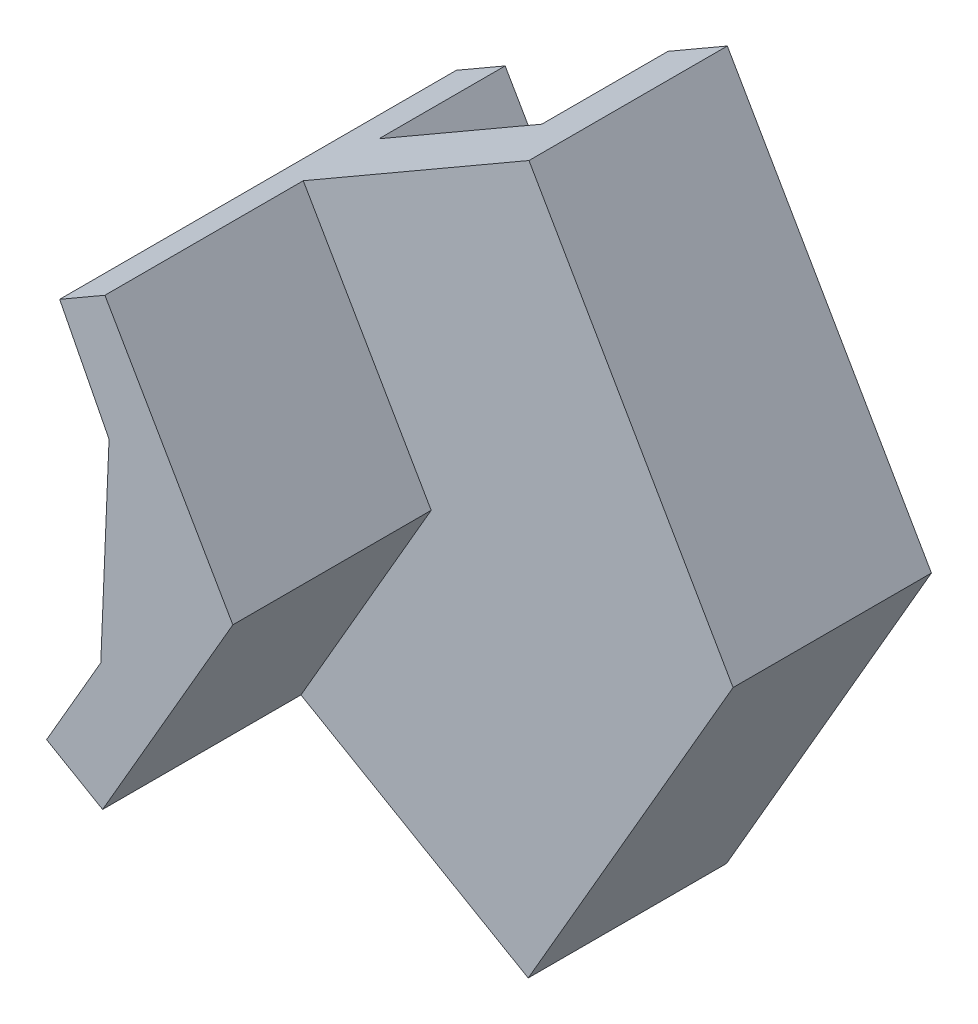
ISO-10303-21;
HEADER;
FILE_DESCRIPTION(('STEP AP214'),'2;1');
FILE_NAME('part.step','',(''),(''),'','','');
FILE_SCHEMA(('AUTOMOTIVE_DESIGN { 1 0 10303 214 1 1 1 1 }'));
ENDSEC;
DATA;
#1=APPLICATION_CONTEXT('core data for automotive mechanical design processes');
#2=APPLICATION_PROTOCOL_DEFINITION('international standard','automotive_design',2000,#1);
#3=PRODUCT_CONTEXT('',#1,'mechanical');
#4=PRODUCT('Part','Part','',(#3));
#5=PRODUCT_RELATED_PRODUCT_CATEGORY('part','',(#4));
#6=PRODUCT_DEFINITION_FORMATION('','',#4);
#7=PRODUCT_DEFINITION_CONTEXT('part definition',#1,'design');
#8=PRODUCT_DEFINITION('design','',#6,#7);
#9=PRODUCT_DEFINITION_SHAPE('','',#8);
#10=(LENGTH_UNIT() NAMED_UNIT(*) SI_UNIT(.MILLI.,.METRE.));
#11=(NAMED_UNIT(*) PLANE_ANGLE_UNIT() SI_UNIT($,.RADIAN.));
#12=(NAMED_UNIT(*) SI_UNIT($,.STERADIAN.) SOLID_ANGLE_UNIT());
#13=UNCERTAINTY_MEASURE_WITH_UNIT(LENGTH_MEASURE(1.E-05),#10,'distance_accuracy_value','');
#14=(GEOMETRIC_REPRESENTATION_CONTEXT(3) GLOBAL_UNCERTAINTY_ASSIGNED_CONTEXT((#13)) GLOBAL_UNIT_ASSIGNED_CONTEXT((#10,
#11,#12)) REPRESENTATION_CONTEXT('',''));
#15=CARTESIAN_POINT('',(0.,0.,0.));
#16=DIRECTION('',(0.,0.,1.));
#17=DIRECTION('',(1.,0.,0.));
#18=AXIS2_PLACEMENT_3D('',#15,#16,#17);
#19=CARTESIAN_POINT('',(0.,0.,0.));
#20=DIRECTION('',(0.,0.,1.));
#21=DIRECTION('',(1.,0.,0.));
#22=AXIS2_PLACEMENT_3D('',#19,#20,#21);
#23=PLANE('',#22);
#24=DIRECTION('',(0.5009159002631,0.865495962361239,0.));
#25=VECTOR('',#24,1.);
#26=CARTESIAN_POINT('',(79.3562570665943,-45.9283609383633,0.));
#27=LINE('',#26,#25);
#28=CARTESIAN_POINT('',(100.841807638242,-8.8050489031459,0.));
#29=VERTEX_POINT('',#28);
#30=CARTESIAN_POINT('',(105.980454031403,0.073642515807458,0.));
#31=VERTEX_POINT('',#30);
#32=EDGE_CURVE('E169',#29,#31,#27,.T.);
#33=ORIENTED_EDGE('',*,*,#32,.F.);
#34=DIRECTION('',(0.865495962361239,-0.500915900263101,0.));
#35=VECTOR('',#34,1.);
#36=CARTESIAN_POINT('',(94.6311821753141,-5.2105768544585,0.));
#37=LINE('',#36,#35);
#38=CARTESIAN_POINT('',(96.3412286339642,-6.20028622177839,0.));
#39=VERTEX_POINT('',#38);
#40=EDGE_CURVE('E236',#39,#29,#37,.T.);
#41=ORIENTED_EDGE('',*,*,#40,.F.);
#42=DIRECTION('',(-0.508210942680143,-0.861232626959848,0.));
#43=VECTOR('',#42,1.);
#44=CARTESIAN_POINT('',(74.1721638004044,-43.7687845369877,0.));
#45=LINE('',#44,#43);
#46=CARTESIAN_POINT('',(100.000000028321,-1.2296559603886E-08,0.));
#47=VERTEX_POINT('',#46);
#48=EDGE_CURVE('E207',#47,#39,#45,.T.);
#49=ORIENTED_EDGE('',*,*,#48,.F.);
#50=DIRECTION('',(0.500000000000233,-0.866025403784304,0.));
#51=VECTOR('',#50,1.);
#52=CARTESIAN_POINT('',(75.0000000158928,43.3012701984246,0.));
#53=LINE('',#52,#51);
#54=CARTESIAN_POINT('',(96.3469671593931,6.32723851840156,0.));
#55=VERTEX_POINT('',#54);
#56=EDGE_CURVE('E202',#55,#47,#53,.T.);
#57=ORIENTED_EDGE('',*,*,#56,.F.);
#58=DIRECTION('',(-0.865938417345993,-0.500150634673512,0.));
#59=VECTOR('',#58,1.);
#60=CARTESIAN_POINT('',(102.507485030802,9.88544411545314,0.));
#61=LINE('',#60,#59);
#62=CARTESIAN_POINT('',(100.862200723799,8.93515715060436,0.));
#63=VERTEX_POINT('',#62);
#64=EDGE_CURVE('E239',#63,#55,#61,.T.);
#65=ORIENTED_EDGE('',*,*,#64,.F.);
#66=DIRECTION('',(-0.500150634673513,0.865938417345993,0.));
#67=VECTOR('',#66,1.);
#68=CARTESIAN_POINT('',(79.5012683354281,45.9185191681202,0.));
#69=LINE('',#68,#67);
#70=EDGE_CURVE('E172',#31,#63,#69,.T.);
#71=ORIENTED_EDGE('',*,*,#70,.F.);
#72=EDGE_LOOP('',(#33,#41,#49,#57,#65,#71));
#73=FACE_BOUND('',#72,.T.);
#74=ADVANCED_FACE('F34',(#73),#23,.F.);
#75=CARTESIAN_POINT('',(96.1339298761034,-2.61408896737479,2.));
#76=DIRECTION('',(0.865495962361239,-0.500915900263102,0.));
#77=DIRECTION('',(0.500915900263102,0.865495962361238,0.));
#78=AXIS2_PLACEMENT_3D('',#75,#76,#77);
#79=PLANE('',#78);
#80=DIRECTION('',(0.,0.,-1.));
#81=VECTOR('',#80,1.);
#82=CARTESIAN_POINT('',(96.1339298761034,-2.61408896737479,2.));
#83=LINE('',#82,#81);
#84=CARTESIAN_POINT('',(96.1339298761034,-2.61408896737479,7.5));
#85=VERTEX_POINT('',#84);
#86=CARTESIAN_POINT('',(96.1339298761034,-2.61408896737479,-3.5));
#87=VERTEX_POINT('',#86);
#88=EDGE_CURVE('E244',#85,#87,#83,.T.);
#89=ORIENTED_EDGE('',*,*,#88,.T.);
#90=DIRECTION('',(0.500915900263102,0.865495962361239,0.));
#91=VECTOR('',#90,1.);
#92=CARTESIAN_POINT('',(73.1456316036667,-42.333888889676,-3.5));
#93=LINE('',#92,#91);
#94=CARTESIAN_POINT('',(94.6311821753141,-5.2105768544585,-3.5));
#95=VERTEX_POINT('',#94);
#96=EDGE_CURVE('E212',#95,#87,#93,.T.);
#97=ORIENTED_EDGE('',*,*,#96,.F.);
#98=DIRECTION('',(0.,0.,-1.));
#99=VECTOR('',#98,1.);
#100=CARTESIAN_POINT('',(94.6311821753141,-5.2105768544585,2.));
#101=LINE('',#100,#99);
#102=CARTESIAN_POINT('',(94.6311821753141,-5.2105768544585,7.5));
#103=VERTEX_POINT('',#102);
#104=EDGE_CURVE('E11',#103,#95,#101,.T.);
#105=ORIENTED_EDGE('',*,*,#104,.F.);
#106=DIRECTION('',(-0.500915900263102,-0.865495962361238,0.));
#107=VECTOR('',#106,1.);
#108=CARTESIAN_POINT('',(94.6311821753141,-5.2105768544585,7.5));
#109=LINE('',#108,#107);
#110=EDGE_CURVE('E162',#85,#103,#109,.T.);
#111=ORIENTED_EDGE('',*,*,#110,.F.);
#112=EDGE_LOOP('',(#89,#97,#105,#111));
#113=FACE_BOUND('',#112,.T.);
#114=ADVANCED_FACE('F36',(#113),#79,.F.);
#115=CARTESIAN_POINT('',(94.6311821753141,-5.2105768544585,2.));
#116=DIRECTION('',(0.500915900263101,0.865495962361239,0.));
#117=DIRECTION('',(-0.865495962361239,0.500915900263101,0.));
#118=AXIS2_PLACEMENT_3D('',#115,#116,#117);
#119=PLANE('',#118);
#120=ORIENTED_EDGE('',*,*,#104,.T.);
#121=DIRECTION('',(-0.865495962361239,0.500915900263101,0.));
#122=VECTOR('',#121,1.);
#123=CARTESIAN_POINT('',(21.4855505716473,37.1233120352174,-3.5));
#124=LINE('',#123,#122);
#125=CARTESIAN_POINT('',(96.3412286339642,-6.20028622177839,-3.5));
#126=VERTEX_POINT('',#125);
#127=EDGE_CURVE('E209',#126,#95,#124,.T.);
#128=ORIENTED_EDGE('',*,*,#127,.F.);
#129=DIRECTION('',(0.,0.,1.));
#130=VECTOR('',#129,1.);
#131=CARTESIAN_POINT('',(96.3412286339642,-6.20028622177839,-3.5));
#132=LINE('',#131,#130);
#133=EDGE_CURVE('E230',#126,#39,#132,.T.);
#134=ORIENTED_EDGE('',*,*,#133,.T.);
#135=ORIENTED_EDGE('',*,*,#40,.T.);
#136=DIRECTION('',(0.,0.,1.));
#137=VECTOR('',#136,1.);
#138=CARTESIAN_POINT('',(100.841807638242,-8.8050489031459,-3.5));
#139=LINE('',#138,#137);
#140=CARTESIAN_POINT('',(100.841807638242,-8.8050489031459,-3.5));
#141=VERTEX_POINT('',#140);
#142=EDGE_CURVE('E193',#141,#29,#139,.T.);
#143=ORIENTED_EDGE('',*,*,#142,.F.);
#144=DIRECTION('',(-0.865495962361239,0.500915900263101,0.));
#145=VECTOR('',#144,1.);
#146=CARTESIAN_POINT('',(21.4855505716473,37.1233120352174,-3.5));
#147=LINE('',#146,#145);
#148=CARTESIAN_POINT('',(102.486249966728,-9.75678911364578,-3.5));
#149=VERTEX_POINT('',#148);
#150=EDGE_CURVE('E192',#149,#141,#147,.T.);
#151=ORIENTED_EDGE('',*,*,#150,.F.);
#152=DIRECTION('',(0.,0.,-1.));
#153=VECTOR('',#152,1.);
#154=CARTESIAN_POINT('',(102.486249966728,-9.75678911364578,2.));
#155=LINE('',#154,#153);
#156=CARTESIAN_POINT('',(102.486249966728,-9.75678911364578,2.));
#157=VERTEX_POINT('',#156);
#158=EDGE_CURVE('E42',#157,#149,#155,.T.);
#159=ORIENTED_EDGE('',*,*,#158,.F.);
#160=DIRECTION('',(0.865495962361239,-0.500915900263101,0.));
#161=VECTOR('',#160,1.);
#162=CARTESIAN_POINT('',(94.6311821753141,-5.2105768544585,2.));
#163=LINE('',#162,#161);
#164=CARTESIAN_POINT('',(96.1849625477355,-6.10984539863429,2.));
#165=VERTEX_POINT('',#164);
#166=EDGE_CURVE('E168',#165,#157,#163,.T.);
#167=ORIENTED_EDGE('',*,*,#166,.F.);
#168=DIRECTION('',(0.,0.,-1.));
#169=VECTOR('',#168,1.);
#170=CARTESIAN_POINT('',(96.1849625477355,-6.10984539863429,7.5));
#171=LINE('',#170,#169);
#172=CARTESIAN_POINT('',(96.1849625477355,-6.10984539863429,7.5));
#173=VERTEX_POINT('',#172);
#174=EDGE_CURVE('E149',#173,#165,#171,.T.);
#175=ORIENTED_EDGE('',*,*,#174,.F.);
#176=DIRECTION('',(0.865495962361238,-0.500915900263102,0.));
#177=VECTOR('',#176,1.);
#178=CARTESIAN_POINT('',(96.1849625477355,-6.10984539863429,7.5));
#179=LINE('',#178,#177);
#180=EDGE_CURVE('E155',#103,#173,#179,.T.);
#181=ORIENTED_EDGE('',*,*,#180,.F.);
#182=EDGE_LOOP('',(#120,#128,#134,#135,#143,#151,#159,#167,#175,#181));
#183=FACE_BOUND('',#182,.T.);
#184=ADVANCED_FACE('F166',(#183),#119,.F.);
#185=CARTESIAN_POINT('',(102.486249966728,-9.75678911364578,2.));
#186=DIRECTION('',(-0.86549596236124,0.5009159002631,0.));
#187=DIRECTION('',(-0.5009159002631,-0.86549596236124,0.));
#188=AXIS2_PLACEMENT_3D('',#185,#186,#187);
#189=PLANE('',#188);
#190=ORIENTED_EDGE('',*,*,#158,.T.);
#191=DIRECTION('',(-0.5009159002631,-0.86549596236124,0.));
#192=VECTOR('',#191,1.);
#193=CARTESIAN_POINT('',(81.0006993950807,-46.8801011488631,-3.5));
#194=LINE('',#193,#192);
#195=CARTESIAN_POINT('',(108.167092376059,0.0587231619758322,-3.5));
#196=VERTEX_POINT('',#195);
#197=EDGE_CURVE('E189',#196,#149,#194,.T.);
#198=ORIENTED_EDGE('',*,*,#197,.F.);
#199=DIRECTION('',(0.,0.,-1.));
#200=VECTOR('',#199,1.);
#201=CARTESIAN_POINT('',(108.167092376059,0.0587231619758315,2.));
#202=LINE('',#201,#200);
#203=CARTESIAN_POINT('',(108.167092376059,0.0587231619758315,2.));
#204=VERTEX_POINT('',#203);
#205=EDGE_CURVE('E255',#204,#196,#202,.T.);
#206=ORIENTED_EDGE('',*,*,#205,.F.);
#207=DIRECTION('',(0.5009159002631,0.86549596236124,0.));
#208=VECTOR('',#207,1.);
#209=CARTESIAN_POINT('',(102.486249966728,-9.75678911364578,2.));
#210=LINE('',#209,#208);
#211=EDGE_CURVE('E238',#157,#204,#210,.T.);
#212=ORIENTED_EDGE('',*,*,#211,.F.);
#213=EDGE_LOOP('',(#190,#198,#206,#212));
#214=FACE_BOUND('',#213,.T.);
#215=ADVANCED_FACE('F259',(#214),#189,.F.);
#216=CARTESIAN_POINT('',(108.167092376059,0.0587231619758315,2.));
#217=DIRECTION('',(-0.866553875968017,-0.499083540146142,0.));
#218=DIRECTION('',(0.499083540146142,-0.866553875968017,0.));
#219=AXIS2_PLACEMENT_3D('',#216,#217,#218);
#220=PLANE('',#219);
#221=ORIENTED_EDGE('',*,*,#205,.T.);
#222=DIRECTION('',(0.499083540146142,-0.866553875968017,0.));
#223=VECTOR('',#222,1.);
#224=CARTESIAN_POINT('',(81.2497559864344,46.7950314207775,-3.5));
#225=LINE('',#224,#223);
#226=CARTESIAN_POINT('',(102.507485030802,9.88544411545314,-3.5));
#227=VERTEX_POINT('',#226);
#228=EDGE_CURVE('E186',#227,#196,#225,.T.);
#229=ORIENTED_EDGE('',*,*,#228,.F.);
#230=DIRECTION('',(0.,0.,-1.));
#231=VECTOR('',#230,1.);
#232=CARTESIAN_POINT('',(102.507485030802,9.88544411545314,2.));
#233=LINE('',#232,#231);
#234=CARTESIAN_POINT('',(102.507485030802,9.88544411545314,2.));
#235=VERTEX_POINT('',#234);
#236=EDGE_CURVE('E253',#235,#227,#233,.T.);
#237=ORIENTED_EDGE('',*,*,#236,.F.);
#238=DIRECTION('',(-0.499083540146142,0.866553875968017,0.));
#239=VECTOR('',#238,1.);
#240=CARTESIAN_POINT('',(108.167092376059,0.0587231619758315,2.));
#241=LINE('',#240,#239);
#242=EDGE_CURVE('E241',#204,#235,#241,.T.);
#243=ORIENTED_EDGE('',*,*,#242,.F.);
#244=EDGE_LOOP('',(#221,#229,#237,#243));
#245=FACE_BOUND('',#244,.T.);
#246=ADVANCED_FACE('F283',(#245),#220,.F.);
#247=CARTESIAN_POINT('',(102.507485030802,9.88544411545314,2.));
#248=DIRECTION('',(0.500150634673512,-0.865938417345993,0.));
#249=DIRECTION('',(0.865938417345993,0.500150634673512,0.));
#250=AXIS2_PLACEMENT_3D('',#247,#248,#249);
#251=PLANE('',#250);
#252=ORIENTED_EDGE('',*,*,#236,.T.);
#253=DIRECTION('',(0.865938417345993,0.500150634673512,0.));
#254=VECTOR('',#253,1.);
#255=CARTESIAN_POINT('',(21.360932388371,-36.9833620175158,-3.5));
#256=LINE('',#255,#254);
#257=CARTESIAN_POINT('',(100.862200723799,8.93515715060435,-3.5));
#258=VERTEX_POINT('',#257);
#259=EDGE_CURVE('E183',#258,#227,#256,.T.);
#260=ORIENTED_EDGE('',*,*,#259,.F.);
#261=DIRECTION('',(0.,0.,1.));
#262=VECTOR('',#261,1.);
#263=CARTESIAN_POINT('',(100.862200723799,8.93515715060435,-3.5));
#264=LINE('',#263,#262);
#265=EDGE_CURVE('E198',#258,#63,#264,.T.);
#266=ORIENTED_EDGE('',*,*,#265,.T.);
#267=ORIENTED_EDGE('',*,*,#64,.T.);
#268=DIRECTION('',(0.,0.,1.));
#269=VECTOR('',#268,1.);
#270=CARTESIAN_POINT('',(96.3469671593931,6.32723851840156,-3.5));
#271=LINE('',#270,#269);
#272=CARTESIAN_POINT('',(96.3469671593931,6.32723851840156,-3.5));
#273=VERTEX_POINT('',#272);
#274=EDGE_CURVE('E223',#273,#55,#271,.T.);
#275=ORIENTED_EDGE('',*,*,#274,.F.);
#276=DIRECTION('',(0.865938417345993,0.500150634673512,0.));
#277=VECTOR('',#276,1.);
#278=CARTESIAN_POINT('',(21.360932388371,-36.9833620175158,-3.5));
#279=LINE('',#278,#277);
#280=CARTESIAN_POINT('',(94.9937705305756,5.54565620355812,-3.5));
#281=VERTEX_POINT('',#280);
#282=EDGE_CURVE('E221',#281,#273,#279,.T.);
#283=ORIENTED_EDGE('',*,*,#282,.F.);
#284=DIRECTION('',(0.,0.,-1.));
#285=VECTOR('',#284,1.);
#286=CARTESIAN_POINT('',(94.9937705305756,5.54565620355812,2.));
#287=LINE('',#286,#285);
#288=CARTESIAN_POINT('',(94.9937705305756,5.54565620355812,7.5));
#289=VERTEX_POINT('',#288);
#290=EDGE_CURVE('E251',#289,#281,#287,.T.);
#291=ORIENTED_EDGE('',*,*,#290,.F.);
#292=DIRECTION('',(-0.865938417345993,-0.500150634673512,0.));
#293=VECTOR('',#292,1.);
#294=CARTESIAN_POINT('',(94.9937705305756,5.54565620355812,7.5));
#295=LINE('',#294,#293);
#296=CARTESIAN_POINT('',(96.2486863178631,6.27047325163103,7.5));
#297=VERTEX_POINT('',#296);
#298=EDGE_CURVE('E407',#297,#289,#295,.T.);
#299=ORIENTED_EDGE('',*,*,#298,.F.);
#300=DIRECTION('',(0.,0.,-1.));
#301=VECTOR('',#300,1.);
#302=CARTESIAN_POINT('',(96.2486863178631,6.27047325163103,7.5));
#303=LINE('',#302,#301);
#304=CARTESIAN_POINT('',(96.2486863178631,6.27047325163103,2.));
#305=VERTEX_POINT('',#304);
#306=EDGE_CURVE('E174',#297,#305,#303,.T.);
#307=ORIENTED_EDGE('',*,*,#306,.T.);
#308=DIRECTION('',(-0.865938417345993,-0.500150634673512,0.));
#309=VECTOR('',#308,1.);
#310=CARTESIAN_POINT('',(102.507485030802,9.88544411545314,2.));
#311=LINE('',#310,#309);
#312=EDGE_CURVE('E49',#235,#305,#311,.T.);
#313=ORIENTED_EDGE('',*,*,#312,.F.);
#314=EDGE_LOOP('',(#252,#260,#266,#267,#275,#283,#291,#299,#307,#313));
#315=FACE_BOUND('',#314,.T.);
#316=ADVANCED_FACE('F278',(#315),#251,.F.);
#317=CARTESIAN_POINT('',(94.9937705305756,5.54565620355812,2.));
#318=DIRECTION('',(0.889990036354752,0.45597997235544,0.));
#319=DIRECTION('',(-0.45597997235544,0.889990036354752,0.));
#320=AXIS2_PLACEMENT_3D('',#317,#318,#319);
#321=PLANE('',#320);
#322=ORIENTED_EDGE('',*,*,#290,.T.);
#323=DIRECTION('',(-0.45597997235544,0.889990036354752,0.));
#324=VECTOR('',#323,1.);
#325=CARTESIAN_POINT('',(77.4934059741465,39.703187305948,-3.5));
#326=LINE('',#325,#324);
#327=CARTESIAN_POINT('',(96.3634427596229,2.87230493633701,-3.5));
#328=VERTEX_POINT('',#327);
#329=EDGE_CURVE('E218',#328,#281,#326,.T.);
#330=ORIENTED_EDGE('',*,*,#329,.F.);
#331=DIRECTION('',(0.,0.,-1.));
#332=VECTOR('',#331,1.);
#333=CARTESIAN_POINT('',(96.3634427596229,2.87230493633701,2.));
#334=LINE('',#333,#332);
#335=CARTESIAN_POINT('',(96.3634427596229,2.87230493633701,7.5));
#336=VERTEX_POINT('',#335);
#337=EDGE_CURVE('E249',#336,#328,#334,.T.);
#338=ORIENTED_EDGE('',*,*,#337,.F.);
#339=DIRECTION('',(0.455979972355439,-0.889990036354752,0.));
#340=VECTOR('',#339,1.);
#341=CARTESIAN_POINT('',(96.3634427596229,2.87230493633701,7.5));
#342=LINE('',#341,#340);
#343=EDGE_CURVE('E404',#289,#336,#342,.T.);
#344=ORIENTED_EDGE('',*,*,#343,.F.);
#345=EDGE_LOOP('',(#322,#330,#338,#344));
#346=FACE_BOUND('',#345,.T.);
#347=ADVANCED_FACE('F296',(#346),#321,.F.);
#348=CARTESIAN_POINT('',(96.3634427596229,2.87230493633701,2.));
#349=DIRECTION('',(0.999126142506004,-0.0417965472386425,0.));
#350=DIRECTION('',(0.0417965472386425,0.999126142506004,0.));
#351=AXIS2_PLACEMENT_3D('',#348,#349,#350);
#352=PLANE('',#351);
#353=ORIENTED_EDGE('',*,*,#337,.T.);
#354=DIRECTION('',(0.0417965472386424,0.999126142506004,0.));
#355=VECTOR('',#354,1.);
#356=CARTESIAN_POINT('',(96.0751529918957,-4.01912181019869,-3.5));
#357=LINE('',#356,#355);
#358=EDGE_CURVE('E215',#87,#328,#357,.T.);
#359=ORIENTED_EDGE('',*,*,#358,.F.);
#360=ORIENTED_EDGE('',*,*,#88,.F.);
#361=DIRECTION('',(-0.0417965472386424,-0.999126142506004,0.));
#362=VECTOR('',#361,1.);
#363=CARTESIAN_POINT('',(96.1339298761034,-2.61408896737479,7.5));
#364=LINE('',#363,#362);
#365=EDGE_CURVE('E400',#336,#85,#364,.T.);
#366=ORIENTED_EDGE('',*,*,#365,.F.);
#367=EDGE_LOOP('',(#353,#359,#360,#366));
#368=FACE_BOUND('',#367,.T.);
#369=ADVANCED_FACE('F287',(#368),#352,.F.);
#370=CARTESIAN_POINT('',(0.,0.,2.));
#371=DIRECTION('',(0.,0.,1.));
#372=DIRECTION('',(1.,0.,0.));
#373=AXIS2_PLACEMENT_3D('',#370,#371,#372);
#374=PLANE('',#373);
#375=DIRECTION('',(-0.500150634673511,0.865938417345993,0.));
#376=VECTOR('',#375,1.);
#377=CARTESIAN_POINT('',(96.2486863178631,6.27047325163103,2.));
#378=LINE('',#377,#376);
#379=CARTESIAN_POINT('',(99.7958297112017,0.129107984481116,2.));
#380=VERTEX_POINT('',#379);
#381=EDGE_CURVE('E164',#380,#305,#378,.T.);
#382=ORIENTED_EDGE('',*,*,#381,.F.);
#383=DIRECTION('',(0.5009159002631,0.86549596236124,0.));
#384=VECTOR('',#383,1.);
#385=CARTESIAN_POINT('',(99.7958297112017,0.129107984481116,2.));
#386=LINE('',#385,#384);
#387=EDGE_CURVE('E55',#165,#380,#386,.T.);
#388=ORIENTED_EDGE('',*,*,#387,.F.);
#389=ORIENTED_EDGE('',*,*,#166,.T.);
#390=ORIENTED_EDGE('',*,*,#211,.T.);
#391=ORIENTED_EDGE('',*,*,#242,.T.);
#392=ORIENTED_EDGE('',*,*,#312,.T.);
#393=EDGE_LOOP('',(#382,#388,#389,#390,#391,#392));
#394=FACE_BOUND('',#393,.T.);
#395=ADVANCED_FACE('F284',(#394),#374,.T.);
#396=CARTESIAN_POINT('',(75.0000000158928,43.3012701984246,-3.5));
#397=DIRECTION('',(-0.866025403784304,-0.500000000000233,0.));
#398=DIRECTION('',(0.500000000000233,-0.866025403784304,0.));
#399=AXIS2_PLACEMENT_3D('',#396,#397,#398);
#400=PLANE('',#399);
#401=ORIENTED_EDGE('',*,*,#56,.T.);
#402=DIRECTION('',(0.,0.,1.));
#403=VECTOR('',#402,1.);
#404=CARTESIAN_POINT('',(100.000000028321,-1.2296559603886E-08,-3.5));
#405=LINE('',#404,#403);
#406=CARTESIAN_POINT('',(100.000000028321,-1.2296559603886E-08,-3.5));
#407=VERTEX_POINT('',#406);
#408=EDGE_CURVE('E233',#407,#47,#405,.T.);
#409=ORIENTED_EDGE('',*,*,#408,.F.);
#410=DIRECTION('',(0.500000000000233,-0.866025403784304,0.));
#411=VECTOR('',#410,1.);
#412=CARTESIAN_POINT('',(75.0000000158928,43.3012701984246,-3.5));
#413=LINE('',#412,#411);
#414=EDGE_CURVE('E203',#273,#407,#413,.T.);
#415=ORIENTED_EDGE('',*,*,#414,.F.);
#416=ORIENTED_EDGE('',*,*,#274,.T.);
#417=EDGE_LOOP('',(#401,#409,#415,#416));
#418=FACE_BOUND('',#417,.T.);
#419=ADVANCED_FACE('F286',(#418),#400,.F.);
#420=CARTESIAN_POINT('',(74.1721638004044,-43.7687845369877,-3.5));
#421=DIRECTION('',(-0.861232626959848,0.508210942680143,0.));
#422=DIRECTION('',(-0.508210942680143,-0.861232626959848,0.));
#423=AXIS2_PLACEMENT_3D('',#420,#421,#422);
#424=PLANE('',#423);
#425=ORIENTED_EDGE('',*,*,#48,.T.);
#426=ORIENTED_EDGE('',*,*,#133,.F.);
#427=DIRECTION('',(-0.508210942680143,-0.861232626959848,0.));
#428=VECTOR('',#427,1.);
#429=CARTESIAN_POINT('',(74.1721638004044,-43.7687845369877,-3.5));
#430=LINE('',#429,#428);
#431=EDGE_CURVE('E206',#407,#126,#430,.T.);
#432=ORIENTED_EDGE('',*,*,#431,.F.);
#433=ORIENTED_EDGE('',*,*,#408,.T.);
#434=EDGE_LOOP('',(#425,#426,#432,#433));
#435=FACE_BOUND('',#434,.T.);
#436=ADVANCED_FACE('F293',(#435),#424,.F.);
#437=CARTESIAN_POINT('',(0.,0.,-3.5));
#438=DIRECTION('',(0.,0.,-1.));
#439=DIRECTION('',(-1.,0.,0.));
#440=AXIS2_PLACEMENT_3D('',#437,#438,#439);
#441=PLANE('',#440);
#442=ORIENTED_EDGE('',*,*,#414,.T.);
#443=ORIENTED_EDGE('',*,*,#431,.T.);
#444=ORIENTED_EDGE('',*,*,#127,.T.);
#445=ORIENTED_EDGE('',*,*,#96,.T.);
#446=ORIENTED_EDGE('',*,*,#358,.T.);
#447=ORIENTED_EDGE('',*,*,#329,.T.);
#448=ORIENTED_EDGE('',*,*,#282,.T.);
#449=EDGE_LOOP('',(#442,#443,#444,#445,#446,#447,#448));
#450=FACE_BOUND('',#449,.T.);
#451=ADVANCED_FACE('F385',(#450),#441,.T.);
#452=CARTESIAN_POINT('',(79.3562570665943,-45.9283609383633,-3.5));
#453=DIRECTION('',(0.865495962361239,-0.5009159002631,0.));
#454=DIRECTION('',(0.5009159002631,0.86549596236124,0.));
#455=AXIS2_PLACEMENT_3D('',#452,#453,#454);
#456=PLANE('',#455);
#457=ORIENTED_EDGE('',*,*,#32,.T.);
#458=DIRECTION('',(0.,0.,1.));
#459=VECTOR('',#458,1.);
#460=CARTESIAN_POINT('',(105.980454031403,0.073642515807458,-3.5));
#461=LINE('',#460,#459);
#462=CARTESIAN_POINT('',(105.980454031403,0.073642515807458,-3.5));
#463=VERTEX_POINT('',#462);
#464=EDGE_CURVE('E200',#463,#31,#461,.T.);
#465=ORIENTED_EDGE('',*,*,#464,.F.);
#466=DIRECTION('',(0.5009159002631,0.865495962361239,0.));
#467=VECTOR('',#466,1.);
#468=CARTESIAN_POINT('',(79.3562570665943,-45.9283609383633,-3.5));
#469=LINE('',#468,#467);
#470=EDGE_CURVE('E178',#141,#463,#469,.T.);
#471=ORIENTED_EDGE('',*,*,#470,.F.);
#472=ORIENTED_EDGE('',*,*,#142,.T.);
#473=EDGE_LOOP('',(#457,#465,#471,#472));
#474=FACE_BOUND('',#473,.T.);
#475=ADVANCED_FACE('F270',(#474),#456,.F.);
#476=CARTESIAN_POINT('',(79.5012683354281,45.9185191681202,-3.5));
#477=DIRECTION('',(0.865938417345993,0.500150634673513,0.));
#478=DIRECTION('',(-0.500150634673513,0.865938417345993,0.));
#479=AXIS2_PLACEMENT_3D('',#476,#477,#478);
#480=PLANE('',#479);
#481=ORIENTED_EDGE('',*,*,#70,.T.);
#482=ORIENTED_EDGE('',*,*,#265,.F.);
#483=DIRECTION('',(-0.500150634673513,0.865938417345993,0.));
#484=VECTOR('',#483,1.);
#485=CARTESIAN_POINT('',(79.5012683354281,45.9185191681202,-3.5));
#486=LINE('',#485,#484);
#487=EDGE_CURVE('E181',#463,#258,#486,.T.);
#488=ORIENTED_EDGE('',*,*,#487,.F.);
#489=ORIENTED_EDGE('',*,*,#464,.T.);
#490=EDGE_LOOP('',(#481,#482,#488,#489));
#491=FACE_BOUND('',#490,.T.);
#492=ADVANCED_FACE('F274',(#491),#480,.F.);
#493=CARTESIAN_POINT('',(0.,0.,-3.5));
#494=DIRECTION('',(0.,0.,-1.));
#495=DIRECTION('',(-1.,0.,0.));
#496=AXIS2_PLACEMENT_3D('',#493,#494,#495);
#497=PLANE('',#496);
#498=ORIENTED_EDGE('',*,*,#470,.T.);
#499=ORIENTED_EDGE('',*,*,#487,.T.);
#500=ORIENTED_EDGE('',*,*,#259,.T.);
#501=ORIENTED_EDGE('',*,*,#228,.T.);
#502=ORIENTED_EDGE('',*,*,#197,.T.);
#503=ORIENTED_EDGE('',*,*,#150,.T.);
#504=EDGE_LOOP('',(#498,#499,#500,#501,#502,#503));
#505=FACE_BOUND('',#504,.T.);
#506=ADVANCED_FACE('F263',(#505),#497,.T.);
#507=CARTESIAN_POINT('',(99.7958297112017,0.129107984481116,7.5));
#508=DIRECTION('',(-0.86549596236124,0.5009159002631,0.));
#509=DIRECTION('',(-0.5009159002631,-0.865495962361239,0.));
#510=AXIS2_PLACEMENT_3D('',#507,#508,#509);
#511=PLANE('',#510);
#512=ORIENTED_EDGE('',*,*,#387,.T.);
#513=DIRECTION('',(0.,0.,-1.));
#514=VECTOR('',#513,1.);
#515=CARTESIAN_POINT('',(99.7958297112017,0.129107984481116,7.5));
#516=LINE('',#515,#514);
#517=CARTESIAN_POINT('',(99.7958297112017,0.129107984481116,7.5));
#518=VERTEX_POINT('',#517);
#519=EDGE_CURVE('E151',#518,#380,#516,.T.);
#520=ORIENTED_EDGE('',*,*,#519,.F.);
#521=DIRECTION('',(0.5009159002631,0.86549596236124,0.));
#522=VECTOR('',#521,1.);
#523=CARTESIAN_POINT('',(99.7958297112017,0.129107984481116,7.5));
#524=LINE('',#523,#522);
#525=EDGE_CURVE('E145',#173,#518,#524,.T.);
#526=ORIENTED_EDGE('',*,*,#525,.F.);
#527=ORIENTED_EDGE('',*,*,#174,.T.);
#528=EDGE_LOOP('',(#512,#520,#526,#527));
#529=FACE_BOUND('',#528,.T.);
#530=ADVANCED_FACE('F147',(#529),#511,.F.);
#531=CARTESIAN_POINT('',(96.2486863178631,6.27047325163103,7.5));
#532=DIRECTION('',(-0.865938417345994,-0.500150634673511,0.));
#533=DIRECTION('',(0.500150634673511,-0.865938417345994,0.));
#534=AXIS2_PLACEMENT_3D('',#531,#532,#533);
#535=PLANE('',#534);
#536=ORIENTED_EDGE('',*,*,#381,.T.);
#537=ORIENTED_EDGE('',*,*,#306,.F.);
#538=DIRECTION('',(-0.500150634673511,0.865938417345993,0.));
#539=VECTOR('',#538,1.);
#540=CARTESIAN_POINT('',(96.2486863178631,6.27047325163103,7.5));
#541=LINE('',#540,#539);
#542=EDGE_CURVE('E154',#518,#297,#541,.T.);
#543=ORIENTED_EDGE('',*,*,#542,.F.);
#544=ORIENTED_EDGE('',*,*,#519,.T.);
#545=EDGE_LOOP('',(#536,#537,#543,#544));
#546=FACE_BOUND('',#545,.T.);
#547=ADVANCED_FACE('F357',(#546),#535,.F.);
#548=CARTESIAN_POINT('',(0.,0.,7.5));
#549=DIRECTION('',(0.,0.,-1.));
#550=DIRECTION('',(-1.,0.,0.));
#551=AXIS2_PLACEMENT_3D('',#548,#549,#550);
#552=PLANE('',#551);
#553=ORIENTED_EDGE('',*,*,#180,.T.);
#554=ORIENTED_EDGE('',*,*,#525,.T.);
#555=ORIENTED_EDGE('',*,*,#542,.T.);
#556=ORIENTED_EDGE('',*,*,#298,.T.);
#557=ORIENTED_EDGE('',*,*,#343,.T.);
#558=ORIENTED_EDGE('',*,*,#365,.T.);
#559=ORIENTED_EDGE('',*,*,#110,.T.);
#560=EDGE_LOOP('',(#553,#554,#555,#556,#557,#558,#559));
#561=FACE_BOUND('',#560,.T.);
#562=ADVANCED_FACE('F159',(#561),#552,.F.);
#563=CLOSED_SHELL('',(#74,#114,#184,#215,#246,#316,#347,#369,#395,#419,#436,#451,#475,#492,#506,
#530,#547,#562));
#564=MANIFOLD_SOLID_BREP('B2',#563);
#565=ADVANCED_BREP_SHAPE_REPRESENTATION('',(#18,#564),#14);
#566=SHAPE_DEFINITION_REPRESENTATION(#9,#565);
ENDSEC;
END-ISO-10303-21;
